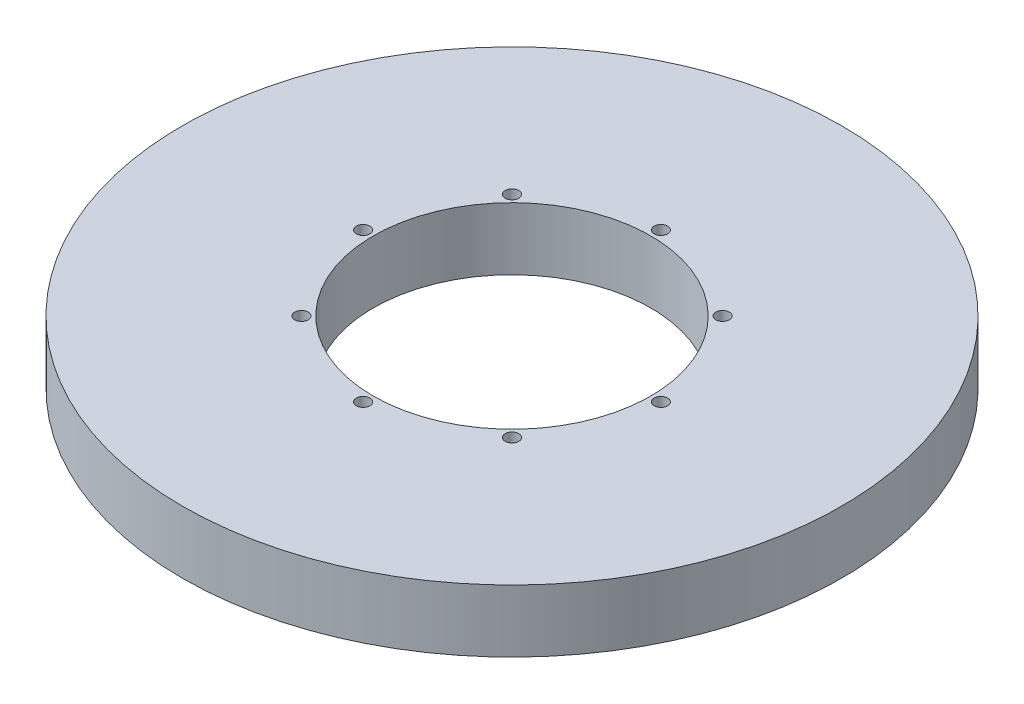
ISO-10303-21;
HEADER;
FILE_DESCRIPTION(('STEP AP214'),'2;1');
FILE_NAME('part.step','',(''),(''),'','','');
FILE_SCHEMA(('AUTOMOTIVE_DESIGN { 1 0 10303 214 1 1 1 1 }'));
ENDSEC;
DATA;
#1=APPLICATION_CONTEXT('core data for automotive mechanical design processes');
#2=APPLICATION_PROTOCOL_DEFINITION('international standard','automotive_design',2000,#1);
#3=PRODUCT_CONTEXT('',#1,'mechanical');
#4=PRODUCT('Part','Part','',(#3));
#5=PRODUCT_RELATED_PRODUCT_CATEGORY('part','',(#4));
#6=PRODUCT_DEFINITION_FORMATION('','',#4);
#7=PRODUCT_DEFINITION_CONTEXT('part definition',#1,'design');
#8=PRODUCT_DEFINITION('design','',#6,#7);
#9=PRODUCT_DEFINITION_SHAPE('','',#8);
#10=(LENGTH_UNIT() NAMED_UNIT(*) SI_UNIT(.MILLI.,.METRE.));
#11=(NAMED_UNIT(*) PLANE_ANGLE_UNIT() SI_UNIT($,.RADIAN.));
#12=(NAMED_UNIT(*) SI_UNIT($,.STERADIAN.) SOLID_ANGLE_UNIT());
#13=UNCERTAINTY_MEASURE_WITH_UNIT(LENGTH_MEASURE(1.E-05),#10,'distance_accuracy_value','');
#14=(GEOMETRIC_REPRESENTATION_CONTEXT(3) GLOBAL_UNCERTAINTY_ASSIGNED_CONTEXT((#13)) GLOBAL_UNIT_ASSIGNED_CONTEXT((#10,
#11,#12)) REPRESENTATION_CONTEXT('',''));
#15=CARTESIAN_POINT('',(0.,0.,0.));
#16=DIRECTION('',(0.,0.,1.));
#17=DIRECTION('',(1.,0.,0.));
#18=AXIS2_PLACEMENT_3D('',#15,#16,#17);
#19=CARTESIAN_POINT('',(0.,18.,0.));
#20=DIRECTION('',(0.,-1.,0.));
#21=DIRECTION('',(0.,0.,-1.));
#22=AXIS2_PLACEMENT_3D('',#19,#20,#21);
#23=CYLINDRICAL_SURFACE('',#22,95.);
#24=CARTESIAN_POINT('',(0.,18.,0.));
#25=DIRECTION('',(0.,1.,0.));
#26=DIRECTION('',(0.,0.,1.));
#27=AXIS2_PLACEMENT_3D('',#24,#25,#26);
#28=CIRCLE('',#27,95.);
#29=CARTESIAN_POINT('',(0.,18.,95.));
#30=VERTEX_POINT('',#29);
#31=EDGE_CURVE('E10',#30,#30,#28,.T.);
#32=ORIENTED_EDGE('',*,*,#31,.F.);
#33=EDGE_LOOP('',(#32));
#34=FACE_BOUND('',#33,.T.);
#35=CARTESIAN_POINT('',(0.,0.,0.));
#36=DIRECTION('',(0.,1.,0.));
#37=DIRECTION('',(0.,0.,1.));
#38=AXIS2_PLACEMENT_3D('',#35,#36,#37);
#39=CIRCLE('',#38,95.);
#40=CARTESIAN_POINT('',(0.,0.,95.));
#41=VERTEX_POINT('',#40);
#42=EDGE_CURVE('E37',#41,#41,#39,.T.);
#43=ORIENTED_EDGE('',*,*,#42,.T.);
#44=EDGE_LOOP('',(#43));
#45=FACE_BOUND('',#44,.T.);
#46=ADVANCED_FACE('F40',(#34,#45),#23,.T.);
#47=CARTESIAN_POINT('',(0.,18.,0.));
#48=DIRECTION('',(0.,1.,0.));
#49=DIRECTION('',(0.,0.,1.));
#50=AXIS2_PLACEMENT_3D('',#47,#48,#49);
#51=PLANE('',#50);
#52=CARTESIAN_POINT('',(1.49853331718963E-13,18.,42.9197000287035));
#53=DIRECTION('',(0.,1.,0.));
#54=DIRECTION('',(1.,0.,0.));
#55=AXIS2_PLACEMENT_3D('',#52,#53,#54);
#56=CIRCLE('',#55,1.94886924430107);
#57=CARTESIAN_POINT('',(1.94886924430122,18.,42.9197000287035));
#58=VERTEX_POINT('',#57);
#59=EDGE_CURVE('E88',#58,#58,#56,.T.);
#60=ORIENTED_EDGE('',*,*,#59,.F.);
#61=EDGE_LOOP('',(#60));
#62=FACE_BOUND('',#61,.T.);
#63=CARTESIAN_POINT('',(30.3488109367888,18.,30.3488109367885));
#64=DIRECTION('',(0.,1.,0.));
#65=DIRECTION('',(0.707106781186544,0.,-0.707106781186551));
#66=AXIS2_PLACEMENT_3D('',#63,#64,#65);
#67=CIRCLE('',#66,1.94886924430107);
#68=CARTESIAN_POINT('',(31.72686959508,18.,28.9707522784973));
#69=VERTEX_POINT('',#68);
#70=EDGE_CURVE('E79',#69,#69,#67,.T.);
#71=ORIENTED_EDGE('',*,*,#70,.F.);
#72=EDGE_LOOP('',(#71));
#73=FACE_BOUND('',#72,.T.);
#74=CARTESIAN_POINT('',(42.9197000287035,18.,0.));
#75=DIRECTION('',(0.,1.,0.));
#76=DIRECTION('',(0.,0.,-1.));
#77=AXIS2_PLACEMENT_3D('',#74,#75,#76);
#78=CIRCLE('',#77,1.94886924430107);
#79=CARTESIAN_POINT('',(42.9197000287035,18.,-1.94886924430107));
#80=VERTEX_POINT('',#79);
#81=EDGE_CURVE('E74',#80,#80,#78,.T.);
#82=ORIENTED_EDGE('',*,*,#81,.F.);
#83=EDGE_LOOP('',(#82));
#84=FACE_BOUND('',#83,.T.);
#85=CARTESIAN_POINT('',(30.3488109367884,18.,-30.3488109367889));
#86=DIRECTION('',(0.,1.,0.));
#87=DIRECTION('',(-0.707106781186554,0.,-0.707106781186541));
#88=AXIS2_PLACEMENT_3D('',#85,#86,#87);
#89=CIRCLE('',#88,1.94886924430107);
#90=CARTESIAN_POINT('',(28.9707522784972,18.,-31.7268695950801));
#91=VERTEX_POINT('',#90);
#92=EDGE_CURVE('E70',#91,#91,#89,.T.);
#93=ORIENTED_EDGE('',*,*,#92,.F.);
#94=EDGE_LOOP('',(#93));
#95=FACE_BOUND('',#94,.T.);
#96=CARTESIAN_POINT('',(-4.4955999515689E-13,18.,-42.9197000287035));
#97=DIRECTION('',(0.,1.,0.));
#98=DIRECTION('',(-1.,0.,0.));
#99=AXIS2_PLACEMENT_3D('',#96,#97,#98);
#100=CIRCLE('',#99,1.94886924430107);
#101=CARTESIAN_POINT('',(-1.94886924430152,18.,-42.9197000287035));
#102=VERTEX_POINT('',#101);
#103=EDGE_CURVE('E100',#102,#102,#100,.T.);
#104=ORIENTED_EDGE('',*,*,#103,.F.);
#105=EDGE_LOOP('',(#104));
#106=FACE_BOUND('',#105,.T.);
#107=CARTESIAN_POINT('',(-30.3488109367891,18.,-30.3488109367883));
#108=DIRECTION('',(0.,1.,0.));
#109=DIRECTION('',(-0.707106781186539,0.,0.707106781186556));
#110=AXIS2_PLACEMENT_3D('',#107,#108,#109);
#111=CIRCLE('',#110,1.94886924430107);
#112=CARTESIAN_POINT('',(-31.7268695950802,18.,-28.9707522784971));
#113=VERTEX_POINT('',#112);
#114=EDGE_CURVE('E93',#113,#113,#111,.T.);
#115=ORIENTED_EDGE('',*,*,#114,.F.);
#116=EDGE_LOOP('',(#115));
#117=FACE_BOUND('',#116,.T.);
#118=CARTESIAN_POINT('',(-30.3488109367886,18.,30.3488109367887));
#119=DIRECTION('',(0.,1.,0.));
#120=DIRECTION('',(0.707106781186549,0.,0.707106781186546));
#121=AXIS2_PLACEMENT_3D('',#118,#119,#120);
#122=CIRCLE('',#121,1.94886924430107);
#123=CARTESIAN_POINT('',(-28.9707522784974,18.,31.7268695950799));
#124=VERTEX_POINT('',#123);
#125=EDGE_CURVE('E61',#124,#124,#122,.T.);
#126=ORIENTED_EDGE('',*,*,#125,.F.);
#127=EDGE_LOOP('',(#126));
#128=FACE_BOUND('',#127,.T.);
#129=CARTESIAN_POINT('',(-42.9197000287035,18.,0.));
#130=DIRECTION('',(0.,1.,0.));
#131=DIRECTION('',(0.,0.,1.));
#132=AXIS2_PLACEMENT_3D('',#129,#130,#131);
#133=CIRCLE('',#132,1.94886924430107);
#134=CARTESIAN_POINT('',(-42.9197000287035,18.,1.94886924430107));
#135=VERTEX_POINT('',#134);
#136=EDGE_CURVE('E54',#135,#135,#133,.T.);
#137=ORIENTED_EDGE('',*,*,#136,.F.);
#138=EDGE_LOOP('',(#137));
#139=FACE_BOUND('',#138,.T.);
#140=CARTESIAN_POINT('',(0.,18.,0.));
#141=DIRECTION('',(0.,1.,0.));
#142=DIRECTION('',(0.,0.,1.));
#143=AXIS2_PLACEMENT_3D('',#140,#141,#142);
#144=CIRCLE('',#143,40.);
#145=CARTESIAN_POINT('',(0.,18.,40.));
#146=VERTEX_POINT('',#145);
#147=EDGE_CURVE('E50',#146,#146,#144,.T.);
#148=ORIENTED_EDGE('',*,*,#147,.F.);
#149=EDGE_LOOP('',(#148));
#150=FACE_BOUND('',#149,.T.);
#151=ORIENTED_EDGE('',*,*,#31,.T.);
#152=EDGE_LOOP('',(#151));
#153=FACE_BOUND('',#152,.T.);
#154=ADVANCED_FACE('F115',(#62,#73,#84,#95,#106,#117,#128,#139,#150,#153),#51,.T.);
#155=CARTESIAN_POINT('',(0.,0.,0.));
#156=DIRECTION('',(0.,1.,0.));
#157=DIRECTION('',(0.,0.,1.));
#158=AXIS2_PLACEMENT_3D('',#155,#156,#157);
#159=PLANE('',#158);
#160=CARTESIAN_POINT('',(0.,0.,0.));
#161=DIRECTION('',(0.,1.,0.));
#162=DIRECTION('',(0.,0.,1.));
#163=AXIS2_PLACEMENT_3D('',#160,#161,#162);
#164=CIRCLE('',#163,40.);
#165=CARTESIAN_POINT('',(0.,0.,40.));
#166=VERTEX_POINT('',#165);
#167=EDGE_CURVE('E47',#166,#166,#164,.T.);
#168=ORIENTED_EDGE('',*,*,#167,.T.);
#169=EDGE_LOOP('',(#168));
#170=FACE_BOUND('',#169,.T.);
#171=ORIENTED_EDGE('',*,*,#42,.F.);
#172=EDGE_LOOP('',(#171));
#173=FACE_BOUND('',#172,.T.);
#174=ADVANCED_FACE('F113',(#170,#173),#159,.F.);
#175=CARTESIAN_POINT('',(0.,18.,0.));
#176=DIRECTION('',(0.,-1.,0.));
#177=DIRECTION('',(0.,0.,-1.));
#178=AXIS2_PLACEMENT_3D('',#175,#176,#177);
#179=CYLINDRICAL_SURFACE('',#178,40.);
#180=ORIENTED_EDGE('',*,*,#147,.T.);
#181=EDGE_LOOP('',(#180));
#182=FACE_BOUND('',#181,.T.);
#183=ORIENTED_EDGE('',*,*,#167,.F.);
#184=EDGE_LOOP('',(#183));
#185=FACE_BOUND('',#184,.T.);
#186=ADVANCED_FACE('F127',(#182,#185),#179,.F.);
#187=CARTESIAN_POINT('',(-42.9197000287035,5.52873049527832,0.));
#188=DIRECTION('',(0.,1.,0.));
#189=DIRECTION('',(0.,0.,1.));
#190=AXIS2_PLACEMENT_3D('',#187,#188,#189);
#191=CYLINDRICAL_SURFACE('',#190,1.94886924430107);
#192=CARTESIAN_POINT('',(-42.9197000287035,5.52873049527832,0.));
#193=DIRECTION('',(0.,1.,0.));
#194=DIRECTION('',(0.,0.,1.));
#195=AXIS2_PLACEMENT_3D('',#192,#193,#194);
#196=CIRCLE('',#195,1.94886924430107);
#197=CARTESIAN_POINT('',(-42.9197000287035,5.52873049527832,1.94886924430107));
#198=VERTEX_POINT('',#197);
#199=EDGE_CURVE('E55',#198,#198,#196,.T.);
#200=ORIENTED_EDGE('',*,*,#199,.F.);
#201=EDGE_LOOP('',(#200));
#202=FACE_BOUND('',#201,.T.);
#203=ORIENTED_EDGE('',*,*,#136,.T.);
#204=EDGE_LOOP('',(#203));
#205=FACE_BOUND('',#204,.T.);
#206=ADVANCED_FACE('F129',(#202,#205),#191,.F.);
#207=CARTESIAN_POINT('',(-42.9197000287035,5.52873049527832,0.));
#208=DIRECTION('',(0.,1.,0.));
#209=DIRECTION('',(0.,0.,1.));
#210=AXIS2_PLACEMENT_3D('',#207,#208,#209);
#211=PLANE('',#210);
#212=ORIENTED_EDGE('',*,*,#199,.T.);
#213=EDGE_LOOP('',(#212));
#214=FACE_BOUND('',#213,.T.);
#215=ADVANCED_FACE('F157',(#214),#211,.T.);
#216=CARTESIAN_POINT('',(-30.3488109367886,5.52873049527832,30.3488109367887));
#217=DIRECTION('',(0.,1.,0.));
#218=DIRECTION('',(0.,0.,1.));
#219=AXIS2_PLACEMENT_3D('',#216,#217,#218);
#220=CYLINDRICAL_SURFACE('',#219,1.94886924430107);
#221=CARTESIAN_POINT('',(-30.3488109367886,5.52873049527832,30.3488109367887));
#222=DIRECTION('',(0.,1.,0.));
#223=DIRECTION('',(0.707106781186549,0.,0.707106781186546));
#224=AXIS2_PLACEMENT_3D('',#221,#222,#223);
#225=CIRCLE('',#224,1.94886924430107);
#226=CARTESIAN_POINT('',(-28.9707522784974,5.52873049527832,31.7268695950799));
#227=VERTEX_POINT('',#226);
#228=EDGE_CURVE('E59',#227,#227,#225,.T.);
#229=ORIENTED_EDGE('',*,*,#228,.F.);
#230=EDGE_LOOP('',(#229));
#231=FACE_BOUND('',#230,.T.);
#232=ORIENTED_EDGE('',*,*,#125,.T.);
#233=EDGE_LOOP('',(#232));
#234=FACE_BOUND('',#233,.T.);
#235=ADVANCED_FACE('F170',(#231,#234),#220,.F.);
#236=CARTESIAN_POINT('',(-30.3488109367886,5.52873049527832,30.3488109367887));
#237=DIRECTION('',(0.,1.,0.));
#238=DIRECTION('',(0.707106781186549,0.,0.707106781186546));
#239=AXIS2_PLACEMENT_3D('',#236,#237,#238);
#240=PLANE('',#239);
#241=ORIENTED_EDGE('',*,*,#228,.T.);
#242=EDGE_LOOP('',(#241));
#243=FACE_BOUND('',#242,.T.);
#244=ADVANCED_FACE('F182',(#243),#240,.T.);
#245=CARTESIAN_POINT('',(-30.3488109367891,5.52873049527832,-30.3488109367883));
#246=DIRECTION('',(0.,1.,0.));
#247=DIRECTION('',(0.,0.,1.));
#248=AXIS2_PLACEMENT_3D('',#245,#246,#247);
#249=CYLINDRICAL_SURFACE('',#248,1.94886924430107);
#250=CARTESIAN_POINT('',(-30.3488109367891,5.52873049527832,-30.3488109367883));
#251=DIRECTION('',(0.,1.,0.));
#252=DIRECTION('',(-0.707106781186539,0.,0.707106781186556));
#253=AXIS2_PLACEMENT_3D('',#250,#251,#252);
#254=CIRCLE('',#253,1.94886924430107);
#255=CARTESIAN_POINT('',(-31.7268695950802,5.52873049527832,-28.9707522784971));
#256=VERTEX_POINT('',#255);
#257=EDGE_CURVE('E94',#256,#256,#254,.T.);
#258=ORIENTED_EDGE('',*,*,#257,.F.);
#259=EDGE_LOOP('',(#258));
#260=FACE_BOUND('',#259,.T.);
#261=ORIENTED_EDGE('',*,*,#114,.T.);
#262=EDGE_LOOP('',(#261));
#263=FACE_BOUND('',#262,.T.);
#264=ADVANCED_FACE('F189',(#260,#263),#249,.F.);
#265=CARTESIAN_POINT('',(-30.3488109367891,5.52873049527832,-30.3488109367883));
#266=DIRECTION('',(0.,1.,0.));
#267=DIRECTION('',(-0.707106781186539,0.,0.707106781186556));
#268=AXIS2_PLACEMENT_3D('',#265,#266,#267);
#269=PLANE('',#268);
#270=ORIENTED_EDGE('',*,*,#257,.T.);
#271=EDGE_LOOP('',(#270));
#272=FACE_BOUND('',#271,.T.);
#273=ADVANCED_FACE('F107',(#272),#269,.T.);
#274=CARTESIAN_POINT('',(-4.4955999515689E-13,5.52873049527832,-42.9197000287035));
#275=DIRECTION('',(0.,1.,0.));
#276=DIRECTION('',(0.,0.,1.));
#277=AXIS2_PLACEMENT_3D('',#274,#275,#276);
#278=CYLINDRICAL_SURFACE('',#277,1.94886924430107);
#279=CARTESIAN_POINT('',(-4.4955999515689E-13,5.52873049527832,-42.9197000287035));
#280=DIRECTION('',(0.,1.,0.));
#281=DIRECTION('',(-1.,0.,0.));
#282=AXIS2_PLACEMENT_3D('',#279,#280,#281);
#283=CIRCLE('',#282,1.94886924430107);
#284=CARTESIAN_POINT('',(-1.94886924430152,5.52873049527832,-42.9197000287035));
#285=VERTEX_POINT('',#284);
#286=EDGE_CURVE('E72',#285,#285,#283,.T.);
#287=ORIENTED_EDGE('',*,*,#286,.F.);
#288=EDGE_LOOP('',(#287));
#289=FACE_BOUND('',#288,.T.);
#290=ORIENTED_EDGE('',*,*,#103,.T.);
#291=EDGE_LOOP('',(#290));
#292=FACE_BOUND('',#291,.T.);
#293=ADVANCED_FACE('F104',(#289,#292),#278,.F.);
#294=CARTESIAN_POINT('',(-4.4955999515689E-13,5.52873049527832,-42.9197000287035));
#295=DIRECTION('',(0.,1.,0.));
#296=DIRECTION('',(-1.,0.,0.));
#297=AXIS2_PLACEMENT_3D('',#294,#295,#296);
#298=PLANE('',#297);
#299=ORIENTED_EDGE('',*,*,#286,.T.);
#300=EDGE_LOOP('',(#299));
#301=FACE_BOUND('',#300,.T.);
#302=ADVANCED_FACE('F103',(#301),#298,.T.);
#303=CARTESIAN_POINT('',(30.3488109367884,5.52873049527832,-30.3488109367889));
#304=DIRECTION('',(0.,1.,0.));
#305=DIRECTION('',(0.,0.,1.));
#306=AXIS2_PLACEMENT_3D('',#303,#304,#305);
#307=CYLINDRICAL_SURFACE('',#306,1.94886924430107);
#308=CARTESIAN_POINT('',(30.3488109367884,5.52873049527832,-30.3488109367889));
#309=DIRECTION('',(0.,1.,0.));
#310=DIRECTION('',(-0.707106781186554,0.,-0.707106781186541));
#311=AXIS2_PLACEMENT_3D('',#308,#309,#310);
#312=CIRCLE('',#311,1.94886924430107);
#313=CARTESIAN_POINT('',(28.9707522784972,5.52873049527832,-31.7268695950801));
#314=VERTEX_POINT('',#313);
#315=EDGE_CURVE('E69',#314,#314,#312,.T.);
#316=ORIENTED_EDGE('',*,*,#315,.F.);
#317=EDGE_LOOP('',(#316));
#318=FACE_BOUND('',#317,.T.);
#319=ORIENTED_EDGE('',*,*,#92,.T.);
#320=EDGE_LOOP('',(#319));
#321=FACE_BOUND('',#320,.T.);
#322=ADVANCED_FACE('F219',(#318,#321),#307,.F.);
#323=CARTESIAN_POINT('',(30.3488109367884,5.52873049527832,-30.3488109367889));
#324=DIRECTION('',(0.,1.,0.));
#325=DIRECTION('',(-0.707106781186554,0.,-0.707106781186541));
#326=AXIS2_PLACEMENT_3D('',#323,#324,#325);
#327=PLANE('',#326);
#328=ORIENTED_EDGE('',*,*,#315,.T.);
#329=EDGE_LOOP('',(#328));
#330=FACE_BOUND('',#329,.T.);
#331=ADVANCED_FACE('F227',(#330),#327,.T.);
#332=CARTESIAN_POINT('',(42.9197000287035,5.52873049527832,0.));
#333=DIRECTION('',(0.,1.,0.));
#334=DIRECTION('',(0.,0.,1.));
#335=AXIS2_PLACEMENT_3D('',#332,#333,#334);
#336=CYLINDRICAL_SURFACE('',#335,1.94886924430107);
#337=CARTESIAN_POINT('',(42.9197000287035,5.52873049527832,0.));
#338=DIRECTION('',(0.,1.,0.));
#339=DIRECTION('',(0.,0.,-1.));
#340=AXIS2_PLACEMENT_3D('',#337,#338,#339);
#341=CIRCLE('',#340,1.94886924430107);
#342=CARTESIAN_POINT('',(42.9197000287035,5.52873049527832,-1.94886924430107));
#343=VERTEX_POINT('',#342);
#344=EDGE_CURVE('E80',#343,#343,#341,.T.);
#345=ORIENTED_EDGE('',*,*,#344,.F.);
#346=EDGE_LOOP('',(#345));
#347=FACE_BOUND('',#346,.T.);
#348=ORIENTED_EDGE('',*,*,#81,.T.);
#349=EDGE_LOOP('',(#348));
#350=FACE_BOUND('',#349,.T.);
#351=ADVANCED_FACE('F240',(#347,#350),#336,.F.);
#352=CARTESIAN_POINT('',(42.9197000287035,5.52873049527832,0.));
#353=DIRECTION('',(0.,1.,0.));
#354=DIRECTION('',(0.,0.,-1.));
#355=AXIS2_PLACEMENT_3D('',#352,#353,#354);
#356=PLANE('',#355);
#357=ORIENTED_EDGE('',*,*,#344,.T.);
#358=EDGE_LOOP('',(#357));
#359=FACE_BOUND('',#358,.T.);
#360=ADVANCED_FACE('F246',(#359),#356,.T.);
#361=CARTESIAN_POINT('',(30.3488109367888,5.52873049527832,30.3488109367885));
#362=DIRECTION('',(0.,1.,0.));
#363=DIRECTION('',(0.,0.,1.));
#364=AXIS2_PLACEMENT_3D('',#361,#362,#363);
#365=CYLINDRICAL_SURFACE('',#364,1.94886924430107);
#366=CARTESIAN_POINT('',(30.3488109367888,5.52873049527832,30.3488109367885));
#367=DIRECTION('',(0.,1.,0.));
#368=DIRECTION('',(0.707106781186544,0.,-0.707106781186551));
#369=AXIS2_PLACEMENT_3D('',#366,#367,#368);
#370=CIRCLE('',#369,1.94886924430107);
#371=CARTESIAN_POINT('',(31.72686959508,5.52873049527832,28.9707522784973));
#372=VERTEX_POINT('',#371);
#373=EDGE_CURVE('E82',#372,#372,#370,.T.);
#374=ORIENTED_EDGE('',*,*,#373,.F.);
#375=EDGE_LOOP('',(#374));
#376=FACE_BOUND('',#375,.T.);
#377=ORIENTED_EDGE('',*,*,#70,.T.);
#378=EDGE_LOOP('',(#377));
#379=FACE_BOUND('',#378,.T.);
#380=ADVANCED_FACE('F254',(#376,#379),#365,.F.);
#381=CARTESIAN_POINT('',(30.3488109367888,5.52873049527832,30.3488109367885));
#382=DIRECTION('',(0.,1.,0.));
#383=DIRECTION('',(0.707106781186544,0.,-0.707106781186551));
#384=AXIS2_PLACEMENT_3D('',#381,#382,#383);
#385=PLANE('',#384);
#386=ORIENTED_EDGE('',*,*,#373,.T.);
#387=EDGE_LOOP('',(#386));
#388=FACE_BOUND('',#387,.T.);
#389=ADVANCED_FACE('F262',(#388),#385,.T.);
#390=CARTESIAN_POINT('',(1.49853331718963E-13,5.52873049527832,42.9197000287035));
#391=DIRECTION('',(0.,1.,0.));
#392=DIRECTION('',(0.,0.,1.));
#393=AXIS2_PLACEMENT_3D('',#390,#391,#392);
#394=CYLINDRICAL_SURFACE('',#393,1.94886924430107);
#395=CARTESIAN_POINT('',(1.49853331718963E-13,5.52873049527832,42.9197000287035));
#396=DIRECTION('',(0.,1.,0.));
#397=DIRECTION('',(1.,0.,0.));
#398=AXIS2_PLACEMENT_3D('',#395,#396,#397);
#399=CIRCLE('',#398,1.94886924430107);
#400=CARTESIAN_POINT('',(1.94886924430122,5.52873049527832,42.9197000287035));
#401=VERTEX_POINT('',#400);
#402=EDGE_CURVE('E63',#401,#401,#399,.T.);
#403=ORIENTED_EDGE('',*,*,#402,.F.);
#404=EDGE_LOOP('',(#403));
#405=FACE_BOUND('',#404,.T.);
#406=ORIENTED_EDGE('',*,*,#59,.T.);
#407=EDGE_LOOP('',(#406));
#408=FACE_BOUND('',#407,.T.);
#409=ADVANCED_FACE('F272',(#405,#408),#394,.F.);
#410=CARTESIAN_POINT('',(1.49853331718963E-13,5.52873049527832,42.9197000287035));
#411=DIRECTION('',(0.,1.,0.));
#412=DIRECTION('',(1.,0.,0.));
#413=AXIS2_PLACEMENT_3D('',#410,#411,#412);
#414=PLANE('',#413);
#415=ORIENTED_EDGE('',*,*,#402,.T.);
#416=EDGE_LOOP('',(#415));
#417=FACE_BOUND('',#416,.T.);
#418=ADVANCED_FACE('F285',(#417),#414,.T.);
#419=CLOSED_SHELL('',(#46,#154,#174,#186,#206,#215,#235,#244,#264,#273,#293,#302,#322,#331,#351,
#360,#380,#389,#409,#418));
#420=MANIFOLD_SOLID_BREP('B2',#419);
#421=ADVANCED_BREP_SHAPE_REPRESENTATION('',(#18,#420),#14);
#422=SHAPE_DEFINITION_REPRESENTATION(#9,#421);
ENDSEC;
END-ISO-10303-21;
